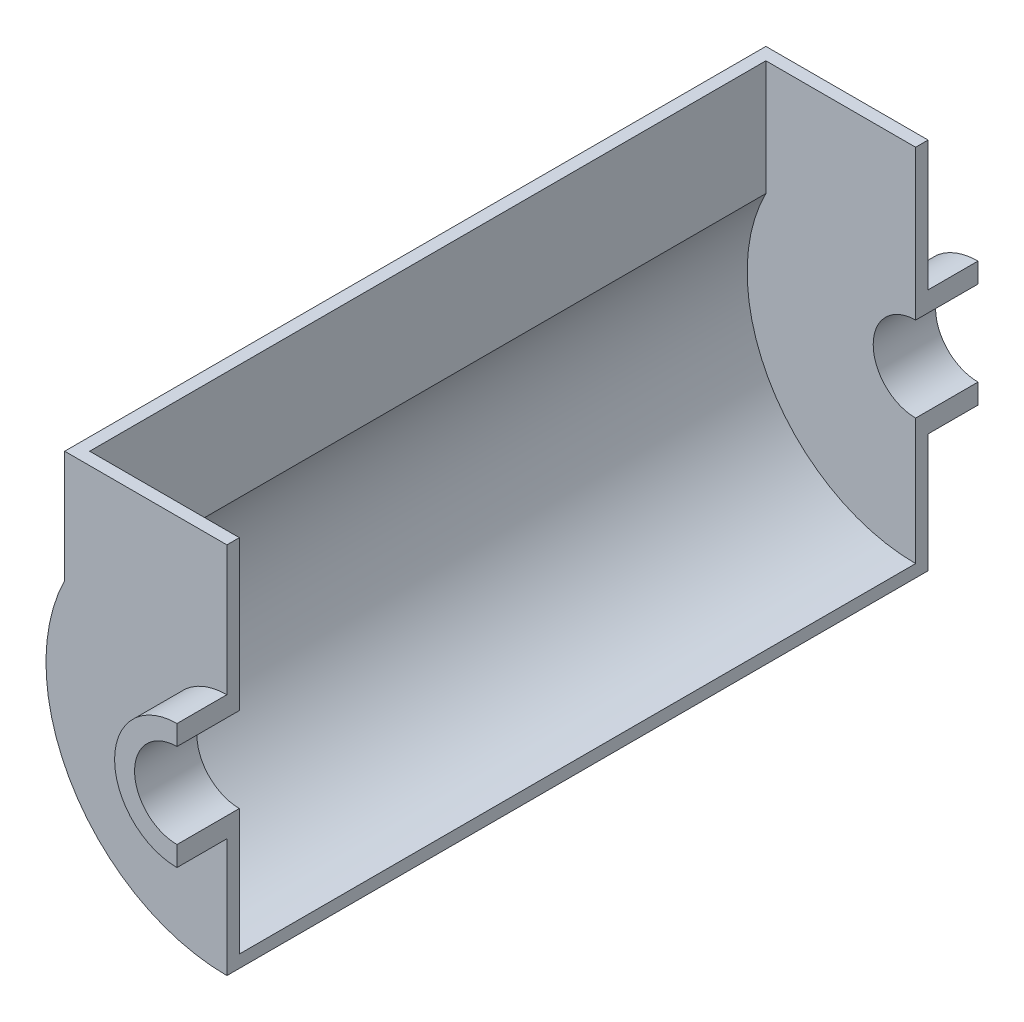
ISO-10303-21;
HEADER;
FILE_DESCRIPTION(('STEP AP214'),'2;1');
FILE_NAME('part.step','',(''),(''),'','','');
FILE_SCHEMA(('AUTOMOTIVE_DESIGN { 1 0 10303 214 1 1 1 1 }'));
ENDSEC;
DATA;
#1=APPLICATION_CONTEXT('core data for automotive mechanical design processes');
#2=APPLICATION_PROTOCOL_DEFINITION('international standard','automotive_design',2000,#1);
#3=PRODUCT_CONTEXT('',#1,'mechanical');
#4=PRODUCT('Part','Part','',(#3));
#5=PRODUCT_RELATED_PRODUCT_CATEGORY('part','',(#4));
#6=PRODUCT_DEFINITION_FORMATION('','',#4);
#7=PRODUCT_DEFINITION_CONTEXT('part definition',#1,'design');
#8=PRODUCT_DEFINITION('design','',#6,#7);
#9=PRODUCT_DEFINITION_SHAPE('','',#8);
#10=(LENGTH_UNIT() NAMED_UNIT(*) SI_UNIT(.MILLI.,.METRE.));
#11=(NAMED_UNIT(*) PLANE_ANGLE_UNIT() SI_UNIT($,.RADIAN.));
#12=(NAMED_UNIT(*) SI_UNIT($,.STERADIAN.) SOLID_ANGLE_UNIT());
#13=UNCERTAINTY_MEASURE_WITH_UNIT(LENGTH_MEASURE(1.E-05),#10,'distance_accuracy_value','');
#14=(GEOMETRIC_REPRESENTATION_CONTEXT(3) GLOBAL_UNCERTAINTY_ASSIGNED_CONTEXT((#13)) GLOBAL_UNIT_ASSIGNED_CONTEXT((#10,
#11,#12)) REPRESENTATION_CONTEXT('',''));
#15=CARTESIAN_POINT('',(0.,0.,0.));
#16=DIRECTION('',(0.,0.,1.));
#17=DIRECTION('',(1.,0.,0.));
#18=AXIS2_PLACEMENT_3D('',#15,#16,#17);
#19=CARTESIAN_POINT('',(0.,0.,-5.));
#20=DIRECTION('',(0.,0.,1.));
#21=DIRECTION('',(1.,0.,0.));
#22=AXIS2_PLACEMENT_3D('',#19,#20,#21);
#23=PLANE('',#22);
#24=CARTESIAN_POINT('',(0.,0.,-5.));
#25=DIRECTION('',(0.,0.,1.));
#26=DIRECTION('',(-1.,0.,0.));
#27=AXIS2_PLACEMENT_3D('',#24,#25,#26);
#28=CIRCLE('',#27,67.5);
#29=CARTESIAN_POINT('',(-60.,30.9232921921324,-5.));
#30=VERTEX_POINT('',#29);
#31=CARTESIAN_POINT('',(0.,-67.5,-5.));
#32=VERTEX_POINT('',#31);
#33=EDGE_CURVE('E196',#30,#32,#28,.T.);
#34=ORIENTED_EDGE('',*,*,#33,.F.);
#35=DIRECTION('',(0.,-1.,0.));
#36=VECTOR('',#35,1.);
#37=CARTESIAN_POINT('',(-60.,77.,-5.));
#38=LINE('',#37,#36);
#39=CARTESIAN_POINT('',(-60.,77.,-5.));
#40=VERTEX_POINT('',#39);
#41=EDGE_CURVE('E53',#40,#30,#38,.T.);
#42=ORIENTED_EDGE('',*,*,#41,.F.);
#43=DIRECTION('',(-1.,0.,0.));
#44=VECTOR('',#43,1.);
#45=CARTESIAN_POINT('',(0.,77.,-5.));
#46=LINE('',#45,#44);
#47=CARTESIAN_POINT('',(0.,77.,-5.));
#48=VERTEX_POINT('',#47);
#49=EDGE_CURVE('E212',#48,#40,#46,.T.);
#50=ORIENTED_EDGE('',*,*,#49,.F.);
#51=DIRECTION('',(0.,1.,0.));
#52=VECTOR('',#51,1.);
#53=CARTESIAN_POINT('',(0.,25.,-5.));
#54=LINE('',#53,#52);
#55=CARTESIAN_POINT('',(0.,17.,-5.));
#56=VERTEX_POINT('',#55);
#57=EDGE_CURVE('E254',#56,#48,#54,.T.);
#58=ORIENTED_EDGE('',*,*,#57,.F.);
#59=CARTESIAN_POINT('',(0.,0.,-5.));
#60=DIRECTION('',(0.,0.,-1.));
#61=DIRECTION('',(1.,0.,0.));
#62=AXIS2_PLACEMENT_3D('',#59,#60,#61);
#63=CIRCLE('',#62,17.);
#64=CARTESIAN_POINT('',(0.,-17.,-5.));
#65=VERTEX_POINT('',#64);
#66=EDGE_CURVE('E251',#65,#56,#63,.T.);
#67=ORIENTED_EDGE('',*,*,#66,.F.);
#68=DIRECTION('',(0.,1.,0.));
#69=VECTOR('',#68,1.);
#70=CARTESIAN_POINT('',(0.,-17.,-5.));
#71=LINE('',#70,#69);
#72=EDGE_CURVE('E59',#32,#65,#71,.T.);
#73=ORIENTED_EDGE('',*,*,#72,.F.);
#74=EDGE_LOOP('',(#34,#42,#50,#58,#67,#73));
#75=FACE_BOUND('',#74,.T.);
#76=ADVANCED_FACE('F36',(#75),#23,.F.);
#77=CARTESIAN_POINT('',(0.,0.,-5.));
#78=DIRECTION('',(0.,0.,1.));
#79=DIRECTION('',(1.,0.,0.));
#80=AXIS2_PLACEMENT_3D('',#77,#78,#79);
#81=CYLINDRICAL_SURFACE('',#80,17.);
#82=DIRECTION('',(0.,0.,1.));
#83=VECTOR('',#82,1.);
#84=CARTESIAN_POINT('',(0.,17.,-5.));
#85=LINE('',#84,#83);
#86=CARTESIAN_POINT('',(0.,17.,20.));
#87=VERTEX_POINT('',#86);
#88=EDGE_CURVE('E40',#56,#87,#85,.T.);
#89=ORIENTED_EDGE('',*,*,#88,.T.);
#90=CARTESIAN_POINT('',(0.,0.,20.));
#91=DIRECTION('',(0.,0.,-1.));
#92=DIRECTION('',(1.,0.,0.));
#93=AXIS2_PLACEMENT_3D('',#90,#91,#92);
#94=CIRCLE('',#93,17.);
#95=CARTESIAN_POINT('',(0.,-17.,20.));
#96=VERTEX_POINT('',#95);
#97=EDGE_CURVE('E234',#96,#87,#94,.T.);
#98=ORIENTED_EDGE('',*,*,#97,.F.);
#99=DIRECTION('',(0.,0.,1.));
#100=VECTOR('',#99,1.);
#101=CARTESIAN_POINT('',(0.,-17.,-5.));
#102=LINE('',#101,#100);
#103=EDGE_CURVE('E11',#65,#96,#102,.T.);
#104=ORIENTED_EDGE('',*,*,#103,.F.);
#105=ORIENTED_EDGE('',*,*,#66,.T.);
#106=EDGE_LOOP('',(#89,#98,#104,#105));
#107=FACE_BOUND('',#106,.T.);
#108=ADVANCED_FACE('F38',(#107),#81,.F.);
#109=CARTESIAN_POINT('',(0.,-17.,-5.));
#110=DIRECTION('',(1.,0.,0.));
#111=DIRECTION('',(0.,0.,-1.));
#112=AXIS2_PLACEMENT_3D('',#109,#110,#111);
#113=PLANE('',#112);
#114=ORIENTED_EDGE('',*,*,#103,.T.);
#115=DIRECTION('',(0.,1.,0.));
#116=VECTOR('',#115,1.);
#117=CARTESIAN_POINT('',(0.,-17.,20.));
#118=LINE('',#117,#116);
#119=CARTESIAN_POINT('',(0.,-25.,20.));
#120=VERTEX_POINT('',#119);
#121=EDGE_CURVE('E248',#120,#96,#118,.T.);
#122=ORIENTED_EDGE('',*,*,#121,.F.);
#123=DIRECTION('',(0.,0.,1.));
#124=VECTOR('',#123,1.);
#125=CARTESIAN_POINT('',(0.,-25.,-5.));
#126=LINE('',#125,#124);
#127=CARTESIAN_POINT('',(0.,-25.,0.));
#128=VERTEX_POINT('',#127);
#129=EDGE_CURVE('E45',#128,#120,#126,.T.);
#130=ORIENTED_EDGE('',*,*,#129,.F.);
#131=DIRECTION('',(0.,1.,0.));
#132=VECTOR('',#131,1.);
#133=CARTESIAN_POINT('',(0.,-25.,0.));
#134=LINE('',#133,#132);
#135=CARTESIAN_POINT('',(0.,-72.5,0.));
#136=VERTEX_POINT('',#135);
#137=EDGE_CURVE('E215',#136,#128,#134,.T.);
#138=ORIENTED_EDGE('',*,*,#137,.F.);
#139=DIRECTION('',(0.,0.,1.));
#140=VECTOR('',#139,1.);
#141=CARTESIAN_POINT('',(0.,-72.5,-5.));
#142=LINE('',#141,#140);
#143=CARTESIAN_POINT('',(0.,-72.5,-281.));
#144=VERTEX_POINT('',#143);
#145=EDGE_CURVE('E232',#144,#136,#142,.T.);
#146=ORIENTED_EDGE('',*,*,#145,.F.);
#147=DIRECTION('',(0.,1.,0.));
#148=VECTOR('',#147,1.);
#149=CARTESIAN_POINT('',(0.,-25.,-281.));
#150=LINE('',#149,#148);
#151=CARTESIAN_POINT('',(0.,-25.,-281.));
#152=VERTEX_POINT('',#151);
#153=EDGE_CURVE('E163',#144,#152,#150,.T.);
#154=ORIENTED_EDGE('',*,*,#153,.T.);
#155=DIRECTION('',(0.,0.,-1.));
#156=VECTOR('',#155,1.);
#157=CARTESIAN_POINT('',(0.,-25.,-276.));
#158=LINE('',#157,#156);
#159=CARTESIAN_POINT('',(0.,-25.,-301.));
#160=VERTEX_POINT('',#159);
#161=EDGE_CURVE('E189',#152,#160,#158,.T.);
#162=ORIENTED_EDGE('',*,*,#161,.T.);
#163=DIRECTION('',(0.,1.,0.));
#164=VECTOR('',#163,1.);
#165=CARTESIAN_POINT('',(0.,-17.,-301.));
#166=LINE('',#165,#164);
#167=CARTESIAN_POINT('',(0.,-17.,-301.));
#168=VERTEX_POINT('',#167);
#169=EDGE_CURVE('E182',#160,#168,#166,.T.);
#170=ORIENTED_EDGE('',*,*,#169,.T.);
#171=DIRECTION('',(0.,0.,-1.));
#172=VECTOR('',#171,1.);
#173=CARTESIAN_POINT('',(0.,-17.,-276.));
#174=LINE('',#173,#172);
#175=CARTESIAN_POINT('',(0.,-17.,-276.));
#176=VERTEX_POINT('',#175);
#177=EDGE_CURVE('E186',#176,#168,#174,.T.);
#178=ORIENTED_EDGE('',*,*,#177,.F.);
#179=DIRECTION('',(0.,1.,0.));
#180=VECTOR('',#179,1.);
#181=CARTESIAN_POINT('',(0.,-17.,-276.));
#182=LINE('',#181,#180);
#183=CARTESIAN_POINT('',(0.,-67.5,-276.));
#184=VERTEX_POINT('',#183);
#185=EDGE_CURVE('E178',#184,#176,#182,.T.);
#186=ORIENTED_EDGE('',*,*,#185,.F.);
#187=DIRECTION('',(0.,0.,1.));
#188=VECTOR('',#187,1.);
#189=CARTESIAN_POINT('',(0.,-67.5,-442.152038807834));
#190=LINE('',#189,#188);
#191=EDGE_CURVE('E199',#184,#32,#190,.T.);
#192=ORIENTED_EDGE('',*,*,#191,.T.);
#193=ORIENTED_EDGE('',*,*,#72,.T.);
#194=EDGE_LOOP('',(#114,#122,#130,#138,#146,#154,#162,#170,#178,#186,#192,#193));
#195=FACE_BOUND('',#194,.T.);
#196=ADVANCED_FACE('F272',(#195),#113,.T.);
#197=CARTESIAN_POINT('',(0.,0.,-5.));
#198=DIRECTION('',(0.,0.,1.));
#199=DIRECTION('',(1.,0.,0.));
#200=AXIS2_PLACEMENT_3D('',#197,#198,#199);
#201=CYLINDRICAL_SURFACE('',#200,25.);
#202=CARTESIAN_POINT('',(0.,0.,0.));
#203=DIRECTION('',(0.,0.,-1.));
#204=DIRECTION('',(1.,0.,0.));
#205=AXIS2_PLACEMENT_3D('',#202,#203,#204);
#206=CIRCLE('',#205,25.);
#207=CARTESIAN_POINT('',(0.,25.,0.));
#208=VERTEX_POINT('',#207);
#209=EDGE_CURVE('E205',#128,#208,#206,.T.);
#210=ORIENTED_EDGE('',*,*,#209,.F.);
#211=ORIENTED_EDGE('',*,*,#129,.T.);
#212=CARTESIAN_POINT('',(0.,0.,20.));
#213=DIRECTION('',(0.,0.,1.));
#214=DIRECTION('',(1.,0.,0.));
#215=AXIS2_PLACEMENT_3D('',#212,#213,#214);
#216=CIRCLE('',#215,25.);
#217=CARTESIAN_POINT('',(0.,25.,20.));
#218=VERTEX_POINT('',#217);
#219=EDGE_CURVE('E245',#218,#120,#216,.T.);
#220=ORIENTED_EDGE('',*,*,#219,.F.);
#221=DIRECTION('',(0.,0.,1.));
#222=VECTOR('',#221,1.);
#223=CARTESIAN_POINT('',(0.,25.,-5.));
#224=LINE('',#223,#222);
#225=EDGE_CURVE('E257',#208,#218,#224,.T.);
#226=ORIENTED_EDGE('',*,*,#225,.F.);
#227=EDGE_LOOP('',(#210,#211,#220,#226));
#228=FACE_BOUND('',#227,.T.);
#229=ADVANCED_FACE('F279',(#228),#201,.T.);
#230=CARTESIAN_POINT('',(0.,25.,-5.));
#231=DIRECTION('',(1.,0.,0.));
#232=DIRECTION('',(0.,0.,-1.));
#233=AXIS2_PLACEMENT_3D('',#230,#231,#232);
#234=PLANE('',#233);
#235=ORIENTED_EDGE('',*,*,#57,.T.);
#236=DIRECTION('',(0.,0.,1.));
#237=VECTOR('',#236,1.);
#238=CARTESIAN_POINT('',(0.,77.,-5.));
#239=LINE('',#238,#237);
#240=CARTESIAN_POINT('',(0.,77.,0.));
#241=VERTEX_POINT('',#240);
#242=EDGE_CURVE('E214',#48,#241,#239,.T.);
#243=ORIENTED_EDGE('',*,*,#242,.T.);
#244=DIRECTION('',(0.,1.,0.));
#245=VECTOR('',#244,1.);
#246=CARTESIAN_POINT('',(0.,25.,0.));
#247=LINE('',#246,#245);
#248=EDGE_CURVE('E218',#208,#241,#247,.T.);
#249=ORIENTED_EDGE('',*,*,#248,.F.);
#250=ORIENTED_EDGE('',*,*,#225,.T.);
#251=DIRECTION('',(0.,1.,0.));
#252=VECTOR('',#251,1.);
#253=CARTESIAN_POINT('',(0.,25.,20.));
#254=LINE('',#253,#252);
#255=EDGE_CURVE('E242',#87,#218,#254,.T.);
#256=ORIENTED_EDGE('',*,*,#255,.F.);
#257=ORIENTED_EDGE('',*,*,#88,.F.);
#258=EDGE_LOOP('',(#235,#243,#249,#250,#256,#257));
#259=FACE_BOUND('',#258,.T.);
#260=ADVANCED_FACE('F265',(#259),#234,.T.);
#261=CARTESIAN_POINT('',(0.,0.,20.));
#262=DIRECTION('',(0.,0.,1.));
#263=DIRECTION('',(1.,0.,0.));
#264=AXIS2_PLACEMENT_3D('',#261,#262,#263);
#265=PLANE('',#264);
#266=ORIENTED_EDGE('',*,*,#97,.T.);
#267=ORIENTED_EDGE('',*,*,#255,.T.);
#268=ORIENTED_EDGE('',*,*,#219,.T.);
#269=ORIENTED_EDGE('',*,*,#121,.T.);
#270=EDGE_LOOP('',(#266,#267,#268,#269));
#271=FACE_BOUND('',#270,.T.);
#272=ADVANCED_FACE('F268',(#271),#265,.T.);
#273=CARTESIAN_POINT('',(0.,0.,-5.));
#274=DIRECTION('',(0.,0.,1.));
#275=DIRECTION('',(1.,0.,0.));
#276=AXIS2_PLACEMENT_3D('',#273,#274,#275);
#277=CYLINDRICAL_SURFACE('',#276,72.5);
#278=CARTESIAN_POINT('',(0.,0.,0.));
#279=DIRECTION('',(0.,0.,1.));
#280=DIRECTION('',(-1.,0.,0.));
#281=AXIS2_PLACEMENT_3D('',#278,#279,#280);
#282=CIRCLE('',#281,72.5);
#283=CARTESIAN_POINT('',(-65.,32.1130814466628,0.));
#284=VERTEX_POINT('',#283);
#285=EDGE_CURVE('E227',#284,#136,#282,.T.);
#286=ORIENTED_EDGE('',*,*,#285,.F.);
#287=DIRECTION('',(0.,0.,1.));
#288=VECTOR('',#287,1.);
#289=CARTESIAN_POINT('',(-65.,32.1130814466628,-5.));
#290=LINE('',#289,#288);
#291=CARTESIAN_POINT('',(-65.,32.1130814466628,-281.));
#292=VERTEX_POINT('',#291);
#293=EDGE_CURVE('E235',#292,#284,#290,.T.);
#294=ORIENTED_EDGE('',*,*,#293,.F.);
#295=CARTESIAN_POINT('',(0.,0.,-281.));
#296=DIRECTION('',(0.,0.,1.));
#297=DIRECTION('',(-1.,0.,0.));
#298=AXIS2_PLACEMENT_3D('',#295,#296,#297);
#299=CIRCLE('',#298,72.5);
#300=EDGE_CURVE('E347',#292,#144,#299,.T.);
#301=ORIENTED_EDGE('',*,*,#300,.T.);
#302=ORIENTED_EDGE('',*,*,#145,.T.);
#303=EDGE_LOOP('',(#286,#294,#301,#302));
#304=FACE_BOUND('',#303,.T.);
#305=ADVANCED_FACE('F295',(#304),#277,.T.);
#306=CARTESIAN_POINT('',(-65.,77.,-5.));
#307=DIRECTION('',(-1.,0.,0.));
#308=DIRECTION('',(0.,-1.,0.));
#309=AXIS2_PLACEMENT_3D('',#306,#307,#308);
#310=PLANE('',#309);
#311=DIRECTION('',(0.,-1.,0.));
#312=VECTOR('',#311,1.);
#313=CARTESIAN_POINT('',(-65.,77.,0.));
#314=LINE('',#313,#312);
#315=CARTESIAN_POINT('',(-65.,77.,0.));
#316=VERTEX_POINT('',#315);
#317=EDGE_CURVE('E224',#316,#284,#314,.T.);
#318=ORIENTED_EDGE('',*,*,#317,.F.);
#319=DIRECTION('',(0.,0.,1.));
#320=VECTOR('',#319,1.);
#321=CARTESIAN_POINT('',(-65.,77.,-5.));
#322=LINE('',#321,#320);
#323=CARTESIAN_POINT('',(-65.,77.,-281.));
#324=VERTEX_POINT('',#323);
#325=EDGE_CURVE('E237',#324,#316,#322,.T.);
#326=ORIENTED_EDGE('',*,*,#325,.F.);
#327=DIRECTION('',(0.,-1.,0.));
#328=VECTOR('',#327,1.);
#329=CARTESIAN_POINT('',(-65.,77.,-281.));
#330=LINE('',#329,#328);
#331=EDGE_CURVE('E349',#324,#292,#330,.T.);
#332=ORIENTED_EDGE('',*,*,#331,.T.);
#333=ORIENTED_EDGE('',*,*,#293,.T.);
#334=EDGE_LOOP('',(#318,#326,#332,#333));
#335=FACE_BOUND('',#334,.T.);
#336=ADVANCED_FACE('F298',(#335),#310,.T.);
#337=CARTESIAN_POINT('',(0.,77.,-5.));
#338=DIRECTION('',(0.,1.,0.));
#339=DIRECTION('',(-1.,0.,0.));
#340=AXIS2_PLACEMENT_3D('',#337,#338,#339);
#341=PLANE('',#340);
#342=DIRECTION('',(-1.,0.,0.));
#343=VECTOR('',#342,1.);
#344=CARTESIAN_POINT('',(0.,77.,0.));
#345=LINE('',#344,#343);
#346=EDGE_CURVE('E221',#241,#316,#345,.T.);
#347=ORIENTED_EDGE('',*,*,#346,.F.);
#348=ORIENTED_EDGE('',*,*,#242,.F.);
#349=ORIENTED_EDGE('',*,*,#49,.T.);
#350=DIRECTION('',(0.,0.,1.));
#351=VECTOR('',#350,1.);
#352=CARTESIAN_POINT('',(-60.,77.,-442.152038807834));
#353=LINE('',#352,#351);
#354=CARTESIAN_POINT('',(-60.,77.,-276.));
#355=VERTEX_POINT('',#354);
#356=EDGE_CURVE('E159',#355,#40,#353,.T.);
#357=ORIENTED_EDGE('',*,*,#356,.F.);
#358=DIRECTION('',(-1.,0.,0.));
#359=VECTOR('',#358,1.);
#360=CARTESIAN_POINT('',(0.,77.,-276.));
#361=LINE('',#360,#359);
#362=CARTESIAN_POINT('',(0.,77.,-276.));
#363=VERTEX_POINT('',#362);
#364=EDGE_CURVE('E151',#363,#355,#361,.T.);
#365=ORIENTED_EDGE('',*,*,#364,.F.);
#366=DIRECTION('',(0.,0.,-1.));
#367=VECTOR('',#366,1.);
#368=CARTESIAN_POINT('',(0.,77.,-276.));
#369=LINE('',#368,#367);
#370=CARTESIAN_POINT('',(0.,77.,-281.));
#371=VERTEX_POINT('',#370);
#372=EDGE_CURVE('E156',#363,#371,#369,.T.);
#373=ORIENTED_EDGE('',*,*,#372,.T.);
#374=DIRECTION('',(-1.,0.,0.));
#375=VECTOR('',#374,1.);
#376=CARTESIAN_POINT('',(0.,77.,-281.));
#377=LINE('',#376,#375);
#378=EDGE_CURVE('E363',#371,#324,#377,.T.);
#379=ORIENTED_EDGE('',*,*,#378,.T.);
#380=ORIENTED_EDGE('',*,*,#325,.T.);
#381=EDGE_LOOP('',(#347,#348,#349,#357,#365,#373,#379,#380));
#382=FACE_BOUND('',#381,.T.);
#383=ADVANCED_FACE('F154',(#382),#341,.T.);
#384=CARTESIAN_POINT('',(0.,0.,0.));
#385=DIRECTION('',(0.,0.,1.));
#386=DIRECTION('',(1.,0.,0.));
#387=AXIS2_PLACEMENT_3D('',#384,#385,#386);
#388=PLANE('',#387);
#389=ORIENTED_EDGE('',*,*,#209,.T.);
#390=ORIENTED_EDGE('',*,*,#248,.T.);
#391=ORIENTED_EDGE('',*,*,#346,.T.);
#392=ORIENTED_EDGE('',*,*,#317,.T.);
#393=ORIENTED_EDGE('',*,*,#285,.T.);
#394=ORIENTED_EDGE('',*,*,#137,.T.);
#395=EDGE_LOOP('',(#389,#390,#391,#392,#393,#394));
#396=FACE_BOUND('',#395,.T.);
#397=ADVANCED_FACE('F277',(#396),#388,.T.);
#398=CARTESIAN_POINT('',(-60.,77.,-442.152038807834));
#399=DIRECTION('',(-1.,0.,0.));
#400=DIRECTION('',(0.,0.,1.));
#401=AXIS2_PLACEMENT_3D('',#398,#399,#400);
#402=PLANE('',#401);
#403=DIRECTION('',(0.,-1.,0.));
#404=VECTOR('',#403,1.);
#405=CARTESIAN_POINT('',(-60.,77.,-276.));
#406=LINE('',#405,#404);
#407=CARTESIAN_POINT('',(-60.,30.9232921921324,-276.));
#408=VERTEX_POINT('',#407);
#409=EDGE_CURVE('E206',#355,#408,#406,.T.);
#410=ORIENTED_EDGE('',*,*,#409,.F.);
#411=ORIENTED_EDGE('',*,*,#356,.T.);
#412=ORIENTED_EDGE('',*,*,#41,.T.);
#413=DIRECTION('',(0.,0.,1.));
#414=VECTOR('',#413,1.);
#415=CARTESIAN_POINT('',(-60.,30.9232921921324,-442.152038807834));
#416=LINE('',#415,#414);
#417=EDGE_CURVE('E200',#408,#30,#416,.T.);
#418=ORIENTED_EDGE('',*,*,#417,.F.);
#419=EDGE_LOOP('',(#410,#411,#412,#418));
#420=FACE_BOUND('',#419,.T.);
#421=ADVANCED_FACE('F307',(#420),#402,.F.);
#422=CARTESIAN_POINT('',(0.,0.,-442.152038807834));
#423=DIRECTION('',(0.,0.,1.));
#424=DIRECTION('',(1.,0.,0.));
#425=AXIS2_PLACEMENT_3D('',#422,#423,#424);
#426=CYLINDRICAL_SURFACE('',#425,67.5);
#427=CARTESIAN_POINT('',(0.,0.,-276.));
#428=DIRECTION('',(0.,0.,-1.));
#429=DIRECTION('',(-1.,0.,0.));
#430=AXIS2_PLACEMENT_3D('',#427,#428,#429);
#431=CIRCLE('',#430,67.5);
#432=EDGE_CURVE('E202',#408,#184,#431,.F.);
#433=ORIENTED_EDGE('',*,*,#432,.F.);
#434=ORIENTED_EDGE('',*,*,#417,.T.);
#435=ORIENTED_EDGE('',*,*,#33,.T.);
#436=ORIENTED_EDGE('',*,*,#191,.F.);
#437=EDGE_LOOP('',(#433,#434,#435,#436));
#438=FACE_BOUND('',#437,.T.);
#439=ADVANCED_FACE('F310',(#438),#426,.F.);
#440=CARTESIAN_POINT('',(0.,0.,-276.));
#441=DIRECTION('',(0.,0.,-1.));
#442=DIRECTION('',(1.,0.,0.));
#443=AXIS2_PLACEMENT_3D('',#440,#441,#442);
#444=PLANE('',#443);
#445=ORIENTED_EDGE('',*,*,#364,.T.);
#446=ORIENTED_EDGE('',*,*,#409,.T.);
#447=ORIENTED_EDGE('',*,*,#432,.T.);
#448=ORIENTED_EDGE('',*,*,#185,.T.);
#449=CARTESIAN_POINT('',(0.,0.,-276.));
#450=DIRECTION('',(0.,0.,-1.));
#451=DIRECTION('',(1.,0.,0.));
#452=AXIS2_PLACEMENT_3D('',#449,#450,#451);
#453=CIRCLE('',#452,17.);
#454=CARTESIAN_POINT('',(0.,17.,-276.));
#455=VERTEX_POINT('',#454);
#456=EDGE_CURVE('E176',#176,#455,#453,.T.);
#457=ORIENTED_EDGE('',*,*,#456,.T.);
#458=DIRECTION('',(0.,1.,0.));
#459=VECTOR('',#458,1.);
#460=CARTESIAN_POINT('',(0.,25.,-276.));
#461=LINE('',#460,#459);
#462=EDGE_CURVE('E168',#455,#363,#461,.T.);
#463=ORIENTED_EDGE('',*,*,#462,.T.);
#464=EDGE_LOOP('',(#445,#446,#447,#448,#457,#463));
#465=FACE_BOUND('',#464,.T.);
#466=ADVANCED_FACE('F174',(#465),#444,.F.);
#467=CARTESIAN_POINT('',(0.,0.,-276.));
#468=DIRECTION('',(0.,0.,-1.));
#469=DIRECTION('',(1.,0.,0.));
#470=AXIS2_PLACEMENT_3D('',#467,#468,#469);
#471=CYLINDRICAL_SURFACE('',#470,17.);
#472=DIRECTION('',(0.,0.,-1.));
#473=VECTOR('',#472,1.);
#474=CARTESIAN_POINT('',(0.,17.,-276.));
#475=LINE('',#474,#473);
#476=CARTESIAN_POINT('',(0.,17.,-301.));
#477=VERTEX_POINT('',#476);
#478=EDGE_CURVE('E180',#455,#477,#475,.T.);
#479=ORIENTED_EDGE('',*,*,#478,.F.);
#480=ORIENTED_EDGE('',*,*,#456,.F.);
#481=ORIENTED_EDGE('',*,*,#177,.T.);
#482=CARTESIAN_POINT('',(0.,0.,-301.));
#483=DIRECTION('',(0.,0.,-1.));
#484=DIRECTION('',(1.,0.,0.));
#485=AXIS2_PLACEMENT_3D('',#482,#483,#484);
#486=CIRCLE('',#485,17.);
#487=EDGE_CURVE('E172',#168,#477,#486,.T.);
#488=ORIENTED_EDGE('',*,*,#487,.T.);
#489=EDGE_LOOP('',(#479,#480,#481,#488));
#490=FACE_BOUND('',#489,.T.);
#491=ADVANCED_FACE('F315',(#490),#471,.F.);
#492=CARTESIAN_POINT('',(0.,0.,-276.));
#493=DIRECTION('',(0.,0.,-1.));
#494=DIRECTION('',(1.,0.,0.));
#495=AXIS2_PLACEMENT_3D('',#492,#493,#494);
#496=CYLINDRICAL_SURFACE('',#495,25.);
#497=CARTESIAN_POINT('',(0.,0.,-281.));
#498=DIRECTION('',(0.,0.,-1.));
#499=DIRECTION('',(1.,0.,0.));
#500=AXIS2_PLACEMENT_3D('',#497,#498,#499);
#501=CIRCLE('',#500,25.);
#502=CARTESIAN_POINT('',(0.,25.,-281.));
#503=VERTEX_POINT('',#502);
#504=EDGE_CURVE('E338',#152,#503,#501,.T.);
#505=ORIENTED_EDGE('',*,*,#504,.T.);
#506=DIRECTION('',(0.,0.,-1.));
#507=VECTOR('',#506,1.);
#508=CARTESIAN_POINT('',(0.,25.,-276.));
#509=LINE('',#508,#507);
#510=CARTESIAN_POINT('',(0.,25.,-301.));
#511=VERTEX_POINT('',#510);
#512=EDGE_CURVE('E192',#503,#511,#509,.T.);
#513=ORIENTED_EDGE('',*,*,#512,.T.);
#514=CARTESIAN_POINT('',(0.,0.,-301.));
#515=DIRECTION('',(0.,0.,1.));
#516=DIRECTION('',(1.,0.,0.));
#517=AXIS2_PLACEMENT_3D('',#514,#515,#516);
#518=CIRCLE('',#517,25.);
#519=EDGE_CURVE('E344',#511,#160,#518,.T.);
#520=ORIENTED_EDGE('',*,*,#519,.T.);
#521=ORIENTED_EDGE('',*,*,#161,.F.);
#522=EDGE_LOOP('',(#505,#513,#520,#521));
#523=FACE_BOUND('',#522,.T.);
#524=ADVANCED_FACE('F318',(#523),#496,.T.);
#525=CARTESIAN_POINT('',(0.,25.,-276.));
#526=DIRECTION('',(1.,0.,0.));
#527=DIRECTION('',(0.,0.,1.));
#528=AXIS2_PLACEMENT_3D('',#525,#526,#527);
#529=PLANE('',#528);
#530=ORIENTED_EDGE('',*,*,#462,.F.);
#531=ORIENTED_EDGE('',*,*,#478,.T.);
#532=DIRECTION('',(0.,1.,0.));
#533=VECTOR('',#532,1.);
#534=CARTESIAN_POINT('',(0.,25.,-301.));
#535=LINE('',#534,#533);
#536=EDGE_CURVE('E355',#477,#511,#535,.T.);
#537=ORIENTED_EDGE('',*,*,#536,.T.);
#538=ORIENTED_EDGE('',*,*,#512,.F.);
#539=DIRECTION('',(0.,1.,0.));
#540=VECTOR('',#539,1.);
#541=CARTESIAN_POINT('',(0.,25.,-281.));
#542=LINE('',#541,#540);
#543=EDGE_CURVE('E171',#503,#371,#542,.T.);
#544=ORIENTED_EDGE('',*,*,#543,.T.);
#545=ORIENTED_EDGE('',*,*,#372,.F.);
#546=EDGE_LOOP('',(#530,#531,#537,#538,#544,#545));
#547=FACE_BOUND('',#546,.T.);
#548=ADVANCED_FACE('F166',(#547),#529,.T.);
#549=CARTESIAN_POINT('',(0.,0.,-301.));
#550=DIRECTION('',(0.,0.,-1.));
#551=DIRECTION('',(1.,0.,0.));
#552=AXIS2_PLACEMENT_3D('',#549,#550,#551);
#553=PLANE('',#552);
#554=ORIENTED_EDGE('',*,*,#487,.F.);
#555=ORIENTED_EDGE('',*,*,#169,.F.);
#556=ORIENTED_EDGE('',*,*,#519,.F.);
#557=ORIENTED_EDGE('',*,*,#536,.F.);
#558=EDGE_LOOP('',(#554,#555,#556,#557));
#559=FACE_BOUND('',#558,.T.);
#560=ADVANCED_FACE('F322',(#559),#553,.T.);
#561=CARTESIAN_POINT('',(0.,0.,-281.));
#562=DIRECTION('',(0.,0.,-1.));
#563=DIRECTION('',(1.,0.,0.));
#564=AXIS2_PLACEMENT_3D('',#561,#562,#563);
#565=PLANE('',#564);
#566=ORIENTED_EDGE('',*,*,#504,.F.);
#567=ORIENTED_EDGE('',*,*,#153,.F.);
#568=ORIENTED_EDGE('',*,*,#300,.F.);
#569=ORIENTED_EDGE('',*,*,#331,.F.);
#570=ORIENTED_EDGE('',*,*,#378,.F.);
#571=ORIENTED_EDGE('',*,*,#543,.F.);
#572=EDGE_LOOP('',(#566,#567,#568,#569,#570,#571));
#573=FACE_BOUND('',#572,.T.);
#574=ADVANCED_FACE('F330',(#573),#565,.T.);
#575=CLOSED_SHELL('',(#76,#108,#196,#229,#260,#272,#305,#336,#383,#397,#421,#439,#466,#491,#524,
#548,#560,#574));
#576=MANIFOLD_SOLID_BREP('B2',#575);
#577=ADVANCED_BREP_SHAPE_REPRESENTATION('',(#18,#576),#14);
#578=SHAPE_DEFINITION_REPRESENTATION(#9,#577);
ENDSEC;
END-ISO-10303-21;
